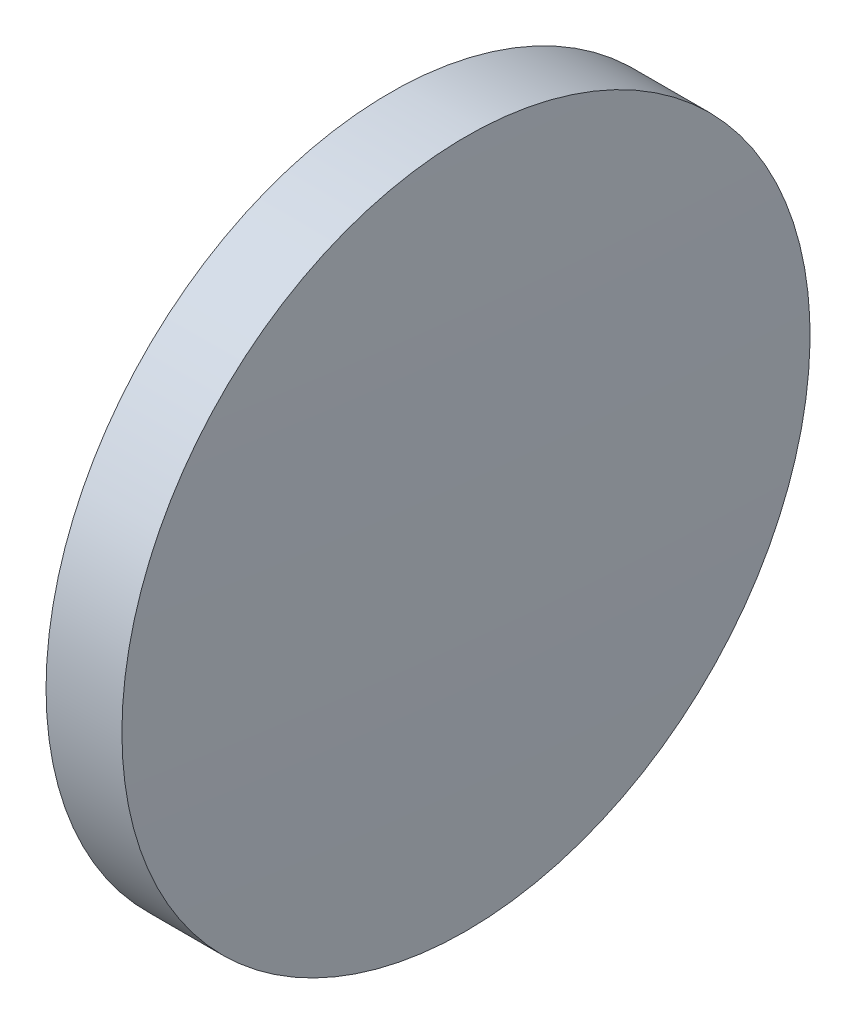
ISO-10303-21;
HEADER;
FILE_DESCRIPTION(('STEP AP214'),'2;1');
FILE_NAME('part.step','',(''),(''),'','','');
FILE_SCHEMA(('AUTOMOTIVE_DESIGN { 1 0 10303 214 1 1 1 1 }'));
ENDSEC;
DATA;
#1=APPLICATION_CONTEXT('core data for automotive mechanical design processes');
#2=APPLICATION_PROTOCOL_DEFINITION('international standard','automotive_design',2000,#1);
#3=PRODUCT_CONTEXT('',#1,'mechanical');
#4=PRODUCT('Part','Part','',(#3));
#5=PRODUCT_RELATED_PRODUCT_CATEGORY('part','',(#4));
#6=PRODUCT_DEFINITION_FORMATION('','',#4);
#7=PRODUCT_DEFINITION_CONTEXT('part definition',#1,'design');
#8=PRODUCT_DEFINITION('design','',#6,#7);
#9=PRODUCT_DEFINITION_SHAPE('','',#8);
#10=(LENGTH_UNIT() NAMED_UNIT(*) SI_UNIT(.MILLI.,.METRE.));
#11=(NAMED_UNIT(*) PLANE_ANGLE_UNIT() SI_UNIT($,.RADIAN.));
#12=(NAMED_UNIT(*) SI_UNIT($,.STERADIAN.) SOLID_ANGLE_UNIT());
#13=UNCERTAINTY_MEASURE_WITH_UNIT(LENGTH_MEASURE(1.E-05),#10,'distance_accuracy_value','');
#14=(GEOMETRIC_REPRESENTATION_CONTEXT(3) GLOBAL_UNCERTAINTY_ASSIGNED_CONTEXT((#13)) GLOBAL_UNIT_ASSIGNED_CONTEXT((#10,
#11,#12)) REPRESENTATION_CONTEXT('',''));
#15=CARTESIAN_POINT('',(0.,0.,0.));
#16=DIRECTION('',(0.,0.,1.));
#17=DIRECTION('',(1.,0.,0.));
#18=AXIS2_PLACEMENT_3D('',#15,#16,#17);
#19=CARTESIAN_POINT('',(-284.454953224051,65.2335549264127,0.));
#20=DIRECTION('',(-1.,0.,0.));
#21=DIRECTION('',(0.,-1.,0.));
#22=AXIS2_PLACEMENT_3D('',#19,#20,#21);
#23=SPHERICAL_SURFACE('',#22,403.324999999995);
#24=CARTESIAN_POINT('',(118.670046775943,65.2335549264122,0.));
#25=DIRECTION('',(-1.,0.,0.));
#26=DIRECTION('',(0.,0.,1.));
#27=AXIS2_PLACEMENT_3D('',#24,#25,#26);
#28=CIRCLE('',#27,12.7);
#29=CARTESIAN_POINT('',(118.670046775943,65.2335549264122,12.7));
#30=VERTEX_POINT('',#29);
#31=EDGE_CURVE('E10',#30,#30,#28,.T.);
#32=ORIENTED_EDGE('',*,*,#31,.F.);
#33=EDGE_LOOP('',(#32));
#34=FACE_BOUND('',#33,.T.);
#35=ADVANCED_FACE('F35',(#34),#23,.T.);
#36=CARTESIAN_POINT('',(110.165373228488,65.2335549264122,0.));
#37=DIRECTION('',(-1.,0.,0.));
#38=DIRECTION('',(0.,0.,1.));
#39=AXIS2_PLACEMENT_3D('',#36,#37,#38);
#40=CYLINDRICAL_SURFACE('',#39,12.7);
#41=CARTESIAN_POINT('',(115.870046775943,65.2335549264122,0.));
#42=DIRECTION('',(-1.,0.,0.));
#43=DIRECTION('',(0.,0.,1.));
#44=AXIS2_PLACEMENT_3D('',#41,#42,#43);
#45=CIRCLE('',#44,12.7);
#46=CARTESIAN_POINT('',(115.870046775943,65.2335549264122,12.7));
#47=VERTEX_POINT('',#46);
#48=EDGE_CURVE('E41',#47,#47,#45,.T.);
#49=ORIENTED_EDGE('',*,*,#48,.F.);
#50=EDGE_LOOP('',(#49));
#51=FACE_BOUND('',#50,.T.);
#52=ORIENTED_EDGE('',*,*,#31,.T.);
#53=EDGE_LOOP('',(#52));
#54=FACE_BOUND('',#53,.T.);
#55=ADVANCED_FACE('F49',(#51,#54),#40,.T.);
#56=CARTESIAN_POINT('',(115.870046775943,65.2335549264122,0.));
#57=DIRECTION('',(1.,0.,0.));
#58=DIRECTION('',(0.,0.,-1.));
#59=AXIS2_PLACEMENT_3D('',#56,#57,#58);
#60=PLANE('',#59);
#61=ORIENTED_EDGE('',*,*,#48,.T.);
#62=EDGE_LOOP('',(#61));
#63=FACE_BOUND('',#62,.T.);
#64=ADVANCED_FACE('F47',(#63),#60,.F.);
#65=CLOSED_SHELL('',(#35,#55,#64));
#66=MANIFOLD_SOLID_BREP('B2',#65);
#67=ADVANCED_BREP_SHAPE_REPRESENTATION('',(#18,#66),#14);
#68=SHAPE_DEFINITION_REPRESENTATION(#9,#67);
ENDSEC;
END-ISO-10303-21;
